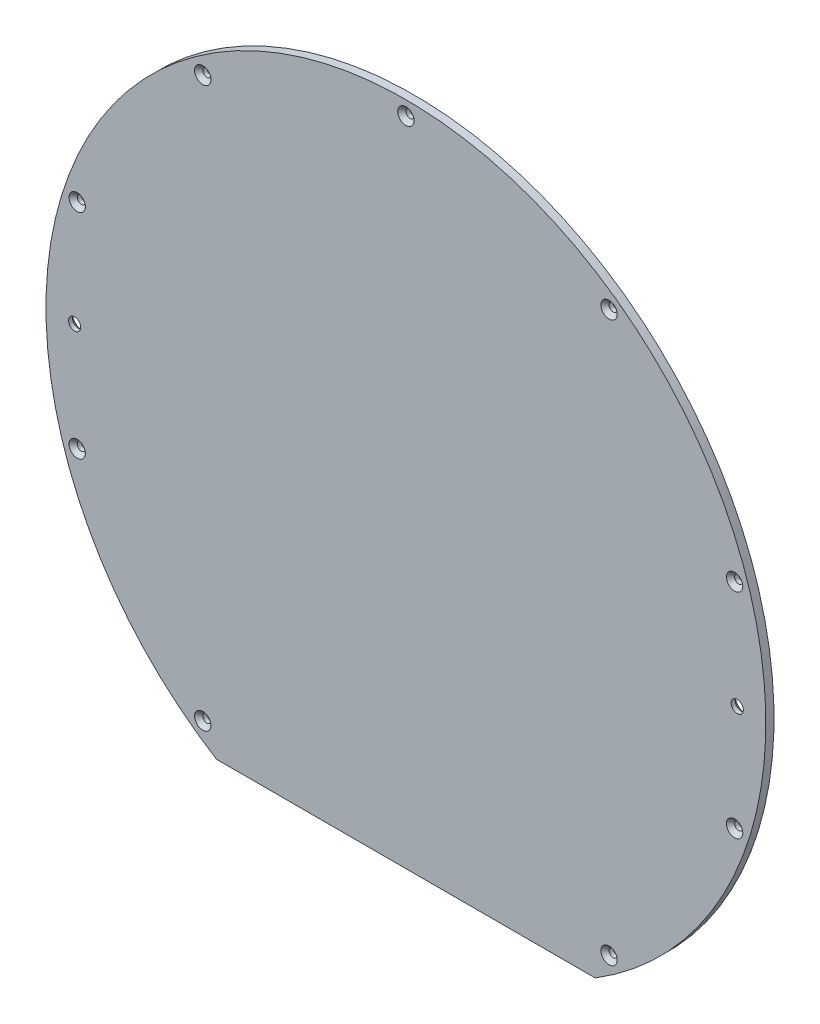
ISO-10303-21;
HEADER;
FILE_DESCRIPTION(('STEP AP214'),'2;1');
FILE_NAME('part.step','',(''),(''),'','','');
FILE_SCHEMA(('AUTOMOTIVE_DESIGN { 1 0 10303 214 1 1 1 1 }'));
ENDSEC;
DATA;
#1=APPLICATION_CONTEXT('core data for automotive mechanical design processes');
#2=APPLICATION_PROTOCOL_DEFINITION('international standard','automotive_design',2000,#1);
#3=PRODUCT_CONTEXT('',#1,'mechanical');
#4=PRODUCT('Part','Part','',(#3));
#5=PRODUCT_RELATED_PRODUCT_CATEGORY('part','',(#4));
#6=PRODUCT_DEFINITION_FORMATION('','',#4);
#7=PRODUCT_DEFINITION_CONTEXT('part definition',#1,'design');
#8=PRODUCT_DEFINITION('design','',#6,#7);
#9=PRODUCT_DEFINITION_SHAPE('','',#8);
#10=(LENGTH_UNIT() NAMED_UNIT(*) SI_UNIT(.MILLI.,.METRE.));
#11=(NAMED_UNIT(*) PLANE_ANGLE_UNIT() SI_UNIT($,.RADIAN.));
#12=(NAMED_UNIT(*) SI_UNIT($,.STERADIAN.) SOLID_ANGLE_UNIT());
#13=UNCERTAINTY_MEASURE_WITH_UNIT(LENGTH_MEASURE(1.E-05),#10,'distance_accuracy_value','');
#14=(GEOMETRIC_REPRESENTATION_CONTEXT(3) GLOBAL_UNCERTAINTY_ASSIGNED_CONTEXT((#13)) GLOBAL_UNIT_ASSIGNED_CONTEXT((#10,
#11,#12)) REPRESENTATION_CONTEXT('',''));
#15=CARTESIAN_POINT('',(0.,0.,0.));
#16=DIRECTION('',(0.,0.,1.));
#17=DIRECTION('',(1.,0.,0.));
#18=AXIS2_PLACEMENT_3D('',#15,#16,#17);
#19=CARTESIAN_POINT('',(0.,0.,2.));
#20=DIRECTION('',(0.,0.,-1.));
#21=DIRECTION('',(-1.,0.,0.));
#22=AXIS2_PLACEMENT_3D('',#19,#20,#21);
#23=CYLINDRICAL_SURFACE('',#22,88.);
#24=CARTESIAN_POINT('',(0.,0.,0.));
#25=DIRECTION('',(0.,0.,1.));
#26=DIRECTION('',(1.,0.,0.));
#27=AXIS2_PLACEMENT_3D('',#24,#25,#26);
#28=CIRCLE('',#27,88.);
#29=CARTESIAN_POINT('',(46.3033476111609,-74.8331477354788,0.));
#30=VERTEX_POINT('',#29);
#31=CARTESIAN_POINT('',(-46.3033476111609,-74.8331477354788,0.));
#32=VERTEX_POINT('',#31);
#33=EDGE_CURVE('E67',#30,#32,#28,.T.);
#34=ORIENTED_EDGE('',*,*,#33,.T.);
#35=DIRECTION('',(0.,0.,-1.));
#36=VECTOR('',#35,1.);
#37=CARTESIAN_POINT('',(-46.3033476111609,-74.8331477354788,2.));
#38=LINE('',#37,#36);
#39=CARTESIAN_POINT('',(-46.3033476111609,-74.8331477354788,2.));
#40=VERTEX_POINT('',#39);
#41=EDGE_CURVE('E64',#40,#32,#38,.T.);
#42=ORIENTED_EDGE('',*,*,#41,.F.);
#43=CARTESIAN_POINT('',(0.,0.,2.));
#44=DIRECTION('',(0.,0.,1.));
#45=DIRECTION('',(1.,0.,0.));
#46=AXIS2_PLACEMENT_3D('',#43,#44,#45);
#47=CIRCLE('',#46,88.);
#48=CARTESIAN_POINT('',(46.3033476111609,-74.8331477354788,2.));
#49=VERTEX_POINT('',#48);
#50=EDGE_CURVE('E66',#49,#40,#47,.T.);
#51=ORIENTED_EDGE('',*,*,#50,.F.);
#52=DIRECTION('',(0.,0.,-1.));
#53=VECTOR('',#52,1.);
#54=CARTESIAN_POINT('',(46.3033476111609,-74.8331477354788,2.));
#55=LINE('',#54,#53);
#56=EDGE_CURVE('E61',#49,#30,#55,.T.);
#57=ORIENTED_EDGE('',*,*,#56,.T.);
#58=EDGE_LOOP('',(#34,#42,#51,#57));
#59=FACE_BOUND('',#58,.T.);
#60=ADVANCED_FACE('F32',(#59),#23,.T.);
#61=CARTESIAN_POINT('',(-46.3033476111609,-74.8331477354788,2.));
#62=DIRECTION('',(0.,1.,0.));
#63=DIRECTION('',(0.,0.,1.));
#64=AXIS2_PLACEMENT_3D('',#61,#62,#63);
#65=PLANE('',#64);
#66=DIRECTION('',(1.,0.,0.));
#67=VECTOR('',#66,1.);
#68=CARTESIAN_POINT('',(-46.3033476111609,-74.8331477354788,0.));
#69=LINE('',#68,#67);
#70=EDGE_CURVE('E56',#32,#30,#69,.T.);
#71=ORIENTED_EDGE('',*,*,#70,.T.);
#72=ORIENTED_EDGE('',*,*,#56,.F.);
#73=DIRECTION('',(1.,0.,0.));
#74=VECTOR('',#73,1.);
#75=CARTESIAN_POINT('',(-46.3033476111609,-74.8331477354788,2.));
#76=LINE('',#75,#74);
#77=EDGE_CURVE('E48',#40,#49,#76,.T.);
#78=ORIENTED_EDGE('',*,*,#77,.F.);
#79=ORIENTED_EDGE('',*,*,#41,.T.);
#80=EDGE_LOOP('',(#71,#72,#78,#79));
#81=FACE_BOUND('',#80,.T.);
#82=ADVANCED_FACE('F60',(#81),#65,.F.);
#83=CARTESIAN_POINT('',(0.,0.,2.));
#84=DIRECTION('',(0.,0.,1.));
#85=DIRECTION('',(1.,0.,0.));
#86=AXIS2_PLACEMENT_3D('',#83,#84,#85);
#87=PLANE('',#86);
#88=CARTESIAN_POINT('',(49.6678538187136,-68.3619360246834,2.));
#89=DIRECTION('',(0.,0.,1.));
#90=DIRECTION('',(1.,0.,0.));
#91=AXIS2_PLACEMENT_3D('',#88,#89,#90);
#92=CIRCLE('',#91,2.00000000000003);
#93=CARTESIAN_POINT('',(51.6678538187136,-68.3619360246834,2.));
#94=VERTEX_POINT('',#93);
#95=EDGE_CURVE('E120',#94,#94,#92,.F.);
#96=ORIENTED_EDGE('',*,*,#95,.T.);
#97=EDGE_LOOP('',(#96));
#98=FACE_BOUND('',#97,.T.);
#99=CARTESIAN_POINT('',(80.3642756269403,-26.1119360246834,2.));
#100=DIRECTION('',(0.,0.,1.));
#101=DIRECTION('',(1.,0.,0.));
#102=AXIS2_PLACEMENT_3D('',#99,#100,#101);
#103=CIRCLE('',#102,2.00000000000003);
#104=CARTESIAN_POINT('',(82.3642756269403,-26.1119360246834,2.));
#105=VERTEX_POINT('',#104);
#106=EDGE_CURVE('E117',#105,#105,#103,.F.);
#107=ORIENTED_EDGE('',*,*,#106,.T.);
#108=EDGE_LOOP('',(#107));
#109=FACE_BOUND('',#108,.T.);
#110=CARTESIAN_POINT('',(80.3642756269406,26.1119360246828,2.));
#111=DIRECTION('',(0.,0.,1.));
#112=DIRECTION('',(1.,0.,0.));
#113=AXIS2_PLACEMENT_3D('',#110,#111,#112);
#114=CIRCLE('',#113,2.00000000000003);
#115=CARTESIAN_POINT('',(82.3642756269406,26.1119360246828,2.));
#116=VERTEX_POINT('',#115);
#117=EDGE_CURVE('E114',#116,#116,#114,.F.);
#118=ORIENTED_EDGE('',*,*,#117,.T.);
#119=EDGE_LOOP('',(#118));
#120=FACE_BOUND('',#119,.T.);
#121=CARTESIAN_POINT('',(49.6678538187141,68.361936024683,2.));
#122=DIRECTION('',(0.,0.,1.));
#123=DIRECTION('',(1.,0.,0.));
#124=AXIS2_PLACEMENT_3D('',#121,#122,#123);
#125=CIRCLE('',#124,2.00000000000003);
#126=CARTESIAN_POINT('',(51.6678538187141,68.361936024683,2.));
#127=VERTEX_POINT('',#126);
#128=EDGE_CURVE('E111',#127,#127,#125,.F.);
#129=ORIENTED_EDGE('',*,*,#128,.T.);
#130=EDGE_LOOP('',(#129));
#131=FACE_BOUND('',#130,.T.);
#132=CARTESIAN_POINT('',(0.,84.5,2.));
#133=DIRECTION('',(0.,0.,1.));
#134=DIRECTION('',(1.,0.,0.));
#135=AXIS2_PLACEMENT_3D('',#132,#133,#134);
#136=CIRCLE('',#135,2.00000000000003);
#137=CARTESIAN_POINT('',(2.00000000000003,84.5,2.));
#138=VERTEX_POINT('',#137);
#139=EDGE_CURVE('E108',#138,#138,#136,.F.);
#140=ORIENTED_EDGE('',*,*,#139,.T.);
#141=EDGE_LOOP('',(#140));
#142=FACE_BOUND('',#141,.T.);
#143=CARTESIAN_POINT('',(-49.6678538187131,68.3619360246837,2.));
#144=DIRECTION('',(0.,0.,1.));
#145=DIRECTION('',(1.,0.,0.));
#146=AXIS2_PLACEMENT_3D('',#143,#144,#145);
#147=CIRCLE('',#146,2.00000000000003);
#148=CARTESIAN_POINT('',(-47.667853818713,68.3619360246837,2.));
#149=VERTEX_POINT('',#148);
#150=EDGE_CURVE('E105',#149,#149,#147,.F.);
#151=ORIENTED_EDGE('',*,*,#150,.T.);
#152=EDGE_LOOP('',(#151));
#153=FACE_BOUND('',#152,.T.);
#154=CARTESIAN_POINT('',(-80.3642756269403,26.111936024684,2.));
#155=DIRECTION('',(0.,0.,1.));
#156=DIRECTION('',(1.,0.,0.));
#157=AXIS2_PLACEMENT_3D('',#154,#155,#156);
#158=CIRCLE('',#157,1.99999999999997);
#159=CARTESIAN_POINT('',(-78.3642756269403,26.111936024684,2.));
#160=VERTEX_POINT('',#159);
#161=EDGE_CURVE('E102',#160,#160,#158,.F.);
#162=ORIENTED_EDGE('',*,*,#161,.T.);
#163=EDGE_LOOP('',(#162));
#164=FACE_BOUND('',#163,.T.);
#165=CARTESIAN_POINT('',(-80.3642756269408,-26.1119360246823,2.));
#166=DIRECTION('',(0.,0.,1.));
#167=DIRECTION('',(1.,0.,0.));
#168=AXIS2_PLACEMENT_3D('',#165,#166,#167);
#169=CIRCLE('',#168,1.99999999999997);
#170=CARTESIAN_POINT('',(-78.3642756269408,-26.1119360246823,2.));
#171=VERTEX_POINT('',#170);
#172=EDGE_CURVE('E99',#171,#171,#169,.F.);
#173=ORIENTED_EDGE('',*,*,#172,.T.);
#174=EDGE_LOOP('',(#173));
#175=FACE_BOUND('',#174,.T.);
#176=CARTESIAN_POINT('',(-49.6678538187146,-68.3619360246827,2.));
#177=DIRECTION('',(0.,0.,1.));
#178=DIRECTION('',(1.,0.,0.));
#179=AXIS2_PLACEMENT_3D('',#176,#177,#178);
#180=CIRCLE('',#179,2.00000000000003);
#181=CARTESIAN_POINT('',(-47.6678538187146,-68.3619360246827,2.));
#182=VERTEX_POINT('',#181);
#183=EDGE_CURVE('E96',#182,#182,#180,.F.);
#184=ORIENTED_EDGE('',*,*,#183,.T.);
#185=EDGE_LOOP('',(#184));
#186=FACE_BOUND('',#185,.T.);
#187=CARTESIAN_POINT('',(-81.,0.,2.));
#188=DIRECTION('',(0.,0.,1.));
#189=DIRECTION('',(1.,0.,0.));
#190=AXIS2_PLACEMENT_3D('',#187,#188,#189);
#191=CIRCLE('',#190,1.5);
#192=CARTESIAN_POINT('',(-79.5,0.,2.));
#193=VERTEX_POINT('',#192);
#194=EDGE_CURVE('E75',#193,#193,#191,.T.);
#195=ORIENTED_EDGE('',*,*,#194,.F.);
#196=EDGE_LOOP('',(#195));
#197=FACE_BOUND('',#196,.T.);
#198=CARTESIAN_POINT('',(81.,0.,2.));
#199=DIRECTION('',(0.,0.,1.));
#200=DIRECTION('',(1.,0.,0.));
#201=AXIS2_PLACEMENT_3D('',#198,#199,#200);
#202=CIRCLE('',#201,1.5);
#203=CARTESIAN_POINT('',(82.5,0.,2.));
#204=VERTEX_POINT('',#203);
#205=EDGE_CURVE('E72',#204,#204,#202,.T.);
#206=ORIENTED_EDGE('',*,*,#205,.F.);
#207=EDGE_LOOP('',(#206));
#208=FACE_BOUND('',#207,.T.);
#209=ORIENTED_EDGE('',*,*,#50,.T.);
#210=ORIENTED_EDGE('',*,*,#77,.T.);
#211=EDGE_LOOP('',(#209,#210));
#212=FACE_BOUND('',#211,.T.);
#213=ADVANCED_FACE('F164',(#98,#109,#120,#131,#142,#153,#164,#175,#186,#197,#208,#212),#87,.T.);
#214=CARTESIAN_POINT('',(0.,0.,0.));
#215=DIRECTION('',(0.,0.,1.));
#216=DIRECTION('',(1.,0.,0.));
#217=AXIS2_PLACEMENT_3D('',#214,#215,#216);
#218=PLANE('',#217);
#219=CARTESIAN_POINT('',(49.6678538187136,-68.3619360246834,0.));
#220=DIRECTION('',(0.,0.,1.));
#221=DIRECTION('',(1.,0.,0.));
#222=AXIS2_PLACEMENT_3D('',#219,#220,#221);
#223=CIRCLE('',#222,0.999999999999992);
#224=CARTESIAN_POINT('',(50.6678538187135,-68.3619360246834,0.));
#225=VERTEX_POINT('',#224);
#226=EDGE_CURVE('E281',#225,#225,#223,.F.);
#227=ORIENTED_EDGE('',*,*,#226,.F.);
#228=EDGE_LOOP('',(#227));
#229=FACE_BOUND('',#228,.T.);
#230=CARTESIAN_POINT('',(80.3642756269403,-26.1119360246834,0.));
#231=DIRECTION('',(0.,0.,1.));
#232=DIRECTION('',(1.,0.,0.));
#233=AXIS2_PLACEMENT_3D('',#230,#231,#232);
#234=CIRCLE('',#233,0.999999999999998);
#235=CARTESIAN_POINT('',(81.3642756269403,-26.1119360246834,0.));
#236=VERTEX_POINT('',#235);
#237=EDGE_CURVE('E282',#236,#236,#234,.F.);
#238=ORIENTED_EDGE('',*,*,#237,.F.);
#239=EDGE_LOOP('',(#238));
#240=FACE_BOUND('',#239,.T.);
#241=CARTESIAN_POINT('',(80.3642756269406,26.1119360246828,0.));
#242=DIRECTION('',(0.,0.,1.));
#243=DIRECTION('',(1.,0.,0.));
#244=AXIS2_PLACEMENT_3D('',#241,#242,#243);
#245=CIRCLE('',#244,0.999999999999998);
#246=CARTESIAN_POINT('',(81.3642756269406,26.1119360246828,0.));
#247=VERTEX_POINT('',#246);
#248=EDGE_CURVE('E285',#247,#247,#245,.F.);
#249=ORIENTED_EDGE('',*,*,#248,.F.);
#250=EDGE_LOOP('',(#249));
#251=FACE_BOUND('',#250,.T.);
#252=CARTESIAN_POINT('',(49.6678538187141,68.361936024683,0.));
#253=DIRECTION('',(0.,0.,1.));
#254=DIRECTION('',(1.,0.,0.));
#255=AXIS2_PLACEMENT_3D('',#252,#253,#254);
#256=CIRCLE('',#255,0.999999999999998);
#257=CARTESIAN_POINT('',(50.6678538187141,68.361936024683,0.));
#258=VERTEX_POINT('',#257);
#259=EDGE_CURVE('E224',#258,#258,#256,.F.);
#260=ORIENTED_EDGE('',*,*,#259,.F.);
#261=EDGE_LOOP('',(#260));
#262=FACE_BOUND('',#261,.T.);
#263=CARTESIAN_POINT('',(0.,84.5,0.));
#264=DIRECTION('',(0.,0.,1.));
#265=DIRECTION('',(1.,0.,0.));
#266=AXIS2_PLACEMENT_3D('',#263,#264,#265);
#267=CIRCLE('',#266,1.);
#268=CARTESIAN_POINT('',(1.,84.5,0.));
#269=VERTEX_POINT('',#268);
#270=EDGE_CURVE('E218',#269,#269,#267,.F.);
#271=ORIENTED_EDGE('',*,*,#270,.F.);
#272=EDGE_LOOP('',(#271));
#273=FACE_BOUND('',#272,.T.);
#274=CARTESIAN_POINT('',(-49.6678538187131,68.3619360246837,0.));
#275=DIRECTION('',(0.,0.,1.));
#276=DIRECTION('',(1.,0.,0.));
#277=AXIS2_PLACEMENT_3D('',#274,#275,#276);
#278=CIRCLE('',#277,1.00000000000001);
#279=CARTESIAN_POINT('',(-48.667853818713,68.3619360246837,0.));
#280=VERTEX_POINT('',#279);
#281=EDGE_CURVE('E215',#280,#280,#278,.F.);
#282=ORIENTED_EDGE('',*,*,#281,.F.);
#283=EDGE_LOOP('',(#282));
#284=FACE_BOUND('',#283,.T.);
#285=CARTESIAN_POINT('',(-80.3642756269403,26.111936024684,0.));
#286=DIRECTION('',(0.,0.,1.));
#287=DIRECTION('',(1.,0.,0.));
#288=AXIS2_PLACEMENT_3D('',#285,#286,#287);
#289=CIRCLE('',#288,0.999999999999998);
#290=CARTESIAN_POINT('',(-79.3642756269403,26.111936024684,0.));
#291=VERTEX_POINT('',#290);
#292=EDGE_CURVE('E217',#291,#291,#289,.F.);
#293=ORIENTED_EDGE('',*,*,#292,.F.);
#294=EDGE_LOOP('',(#293));
#295=FACE_BOUND('',#294,.T.);
#296=CARTESIAN_POINT('',(-80.3642756269408,-26.1119360246823,0.));
#297=DIRECTION('',(0.,0.,1.));
#298=DIRECTION('',(1.,0.,0.));
#299=AXIS2_PLACEMENT_3D('',#296,#297,#298);
#300=CIRCLE('',#299,0.999999999999998);
#301=CARTESIAN_POINT('',(-79.3642756269408,-26.1119360246823,0.));
#302=VERTEX_POINT('',#301);
#303=EDGE_CURVE('E221',#302,#302,#300,.F.);
#304=ORIENTED_EDGE('',*,*,#303,.F.);
#305=EDGE_LOOP('',(#304));
#306=FACE_BOUND('',#305,.T.);
#307=CARTESIAN_POINT('',(-49.6678538187146,-68.3619360246827,0.));
#308=DIRECTION('',(0.,0.,1.));
#309=DIRECTION('',(1.,0.,0.));
#310=AXIS2_PLACEMENT_3D('',#307,#308,#309);
#311=CIRCLE('',#310,1.00000000000001);
#312=CARTESIAN_POINT('',(-48.6678538187146,-68.3619360246827,0.));
#313=VERTEX_POINT('',#312);
#314=EDGE_CURVE('E230',#313,#313,#311,.F.);
#315=ORIENTED_EDGE('',*,*,#314,.F.);
#316=EDGE_LOOP('',(#315));
#317=FACE_BOUND('',#316,.T.);
#318=CARTESIAN_POINT('',(81.,0.,0.));
#319=DIRECTION('',(0.,0.,1.));
#320=DIRECTION('',(1.,0.,0.));
#321=AXIS2_PLACEMENT_3D('',#318,#319,#320);
#322=CIRCLE('',#321,2.50000000000003);
#323=CARTESIAN_POINT('',(83.5,0.,0.));
#324=VERTEX_POINT('',#323);
#325=EDGE_CURVE('E87',#324,#324,#322,.T.);
#326=ORIENTED_EDGE('',*,*,#325,.T.);
#327=EDGE_LOOP('',(#326));
#328=FACE_BOUND('',#327,.T.);
#329=CARTESIAN_POINT('',(-81.,0.,0.));
#330=DIRECTION('',(0.,0.,1.));
#331=DIRECTION('',(1.,0.,0.));
#332=AXIS2_PLACEMENT_3D('',#329,#330,#331);
#333=CIRCLE('',#332,2.49999999999995);
#334=CARTESIAN_POINT('',(-78.5000000000001,0.,0.));
#335=VERTEX_POINT('',#334);
#336=EDGE_CURVE('E84',#335,#335,#333,.T.);
#337=ORIENTED_EDGE('',*,*,#336,.T.);
#338=EDGE_LOOP('',(#337));
#339=FACE_BOUND('',#338,.T.);
#340=ORIENTED_EDGE('',*,*,#33,.F.);
#341=ORIENTED_EDGE('',*,*,#70,.F.);
#342=EDGE_LOOP('',(#340,#341));
#343=FACE_BOUND('',#342,.T.);
#344=ADVANCED_FACE('F71',(#229,#240,#251,#262,#273,#284,#295,#306,#317,#328,#339,#343),#218,.F.);
#345=CARTESIAN_POINT('',(81.,0.,-0.00100000000000013));
#346=DIRECTION('',(0.,0.,1.));
#347=DIRECTION('',(1.,0.,0.));
#348=AXIS2_PLACEMENT_3D('',#345,#346,#347);
#349=CYLINDRICAL_SURFACE('',#348,1.5);
#350=CARTESIAN_POINT('',(81.,0.,1.00000000000004));
#351=DIRECTION('',(0.,0.,1.));
#352=DIRECTION('',(1.,0.,0.));
#353=AXIS2_PLACEMENT_3D('',#350,#351,#352);
#354=CIRCLE('',#353,1.5);
#355=CARTESIAN_POINT('',(82.5,0.,1.00000000000004));
#356=VERTEX_POINT('',#355);
#357=EDGE_CURVE('E81',#356,#356,#354,.F.);
#358=ORIENTED_EDGE('',*,*,#357,.T.);
#359=EDGE_LOOP('',(#358));
#360=FACE_BOUND('',#359,.T.);
#361=ORIENTED_EDGE('',*,*,#205,.T.);
#362=EDGE_LOOP('',(#361));
#363=FACE_BOUND('',#362,.T.);
#364=ADVANCED_FACE('F240',(#360,#363),#349,.F.);
#365=CARTESIAN_POINT('',(-81.,0.,-0.00100000000000013));
#366=DIRECTION('',(0.,0.,1.));
#367=DIRECTION('',(1.,0.,0.));
#368=AXIS2_PLACEMENT_3D('',#365,#366,#367);
#369=CYLINDRICAL_SURFACE('',#368,1.5);
#370=CARTESIAN_POINT('',(-81.,0.,0.999999999999955));
#371=DIRECTION('',(0.,0.,1.));
#372=DIRECTION('',(1.,0.,0.));
#373=AXIS2_PLACEMENT_3D('',#370,#371,#372);
#374=CIRCLE('',#373,1.5);
#375=CARTESIAN_POINT('',(-79.5,0.,0.999999999999955));
#376=VERTEX_POINT('',#375);
#377=EDGE_CURVE('E90',#376,#376,#374,.F.);
#378=ORIENTED_EDGE('',*,*,#377,.T.);
#379=EDGE_LOOP('',(#378));
#380=FACE_BOUND('',#379,.T.);
#381=ORIENTED_EDGE('',*,*,#194,.T.);
#382=EDGE_LOOP('',(#381));
#383=FACE_BOUND('',#382,.T.);
#384=ADVANCED_FACE('F172',(#380,#383),#369,.F.);
#385=CARTESIAN_POINT('',(81.,0.,1.00000000000004));
#386=DIRECTION('',(0.,0.,-1.));
#387=DIRECTION('',(-1.,0.,0.));
#388=AXIS2_PLACEMENT_3D('',#385,#386,#387);
#389=CONICAL_SURFACE('',#388,1.5,0.785398163397446);
#390=ORIENTED_EDGE('',*,*,#325,.F.);
#391=EDGE_LOOP('',(#390));
#392=FACE_BOUND('',#391,.T.);
#393=ORIENTED_EDGE('',*,*,#357,.F.);
#394=EDGE_LOOP('',(#393));
#395=FACE_BOUND('',#394,.T.);
#396=ADVANCED_FACE('F168',(#392,#395),#389,.F.);
#397=CARTESIAN_POINT('',(-81.,0.,0.999999999999955));
#398=DIRECTION('',(0.,0.,-1.));
#399=DIRECTION('',(-1.,0.,0.));
#400=AXIS2_PLACEMENT_3D('',#397,#398,#399);
#401=CONICAL_SURFACE('',#400,1.5,0.785398163397446);
#402=ORIENTED_EDGE('',*,*,#336,.F.);
#403=EDGE_LOOP('',(#402));
#404=FACE_BOUND('',#403,.T.);
#405=ORIENTED_EDGE('',*,*,#377,.F.);
#406=EDGE_LOOP('',(#405));
#407=FACE_BOUND('',#406,.T.);
#408=ADVANCED_FACE('F171',(#404,#407),#401,.F.);
#409=CARTESIAN_POINT('',(-49.6678538187146,-68.3619360246827,-0.00100000000000013));
#410=DIRECTION('',(0.,0.,1.));
#411=DIRECTION('',(1.,0.,0.));
#412=AXIS2_PLACEMENT_3D('',#409,#410,#411);
#413=CYLINDRICAL_SURFACE('',#412,1.00000000000001);
#414=CARTESIAN_POINT('',(-49.6678538187146,-68.3619360246827,1.));
#415=DIRECTION('',(0.,0.,1.));
#416=DIRECTION('',(1.,0.,0.));
#417=AXIS2_PLACEMENT_3D('',#414,#415,#416);
#418=CIRCLE('',#417,1.00000000000001);
#419=CARTESIAN_POINT('',(-48.6678538187146,-68.3619360246827,1.));
#420=VERTEX_POINT('',#419);
#421=EDGE_CURVE('E11',#420,#420,#418,.T.);
#422=ORIENTED_EDGE('',*,*,#421,.T.);
#423=EDGE_LOOP('',(#422));
#424=FACE_BOUND('',#423,.T.);
#425=ORIENTED_EDGE('',*,*,#314,.T.);
#426=EDGE_LOOP('',(#425));
#427=FACE_BOUND('',#426,.T.);
#428=ADVANCED_FACE('F176',(#424,#427),#413,.F.);
#429=CARTESIAN_POINT('',(-80.3642756269408,-26.1119360246823,-0.00100000000000013));
#430=DIRECTION('',(0.,0.,1.));
#431=DIRECTION('',(1.,0.,0.));
#432=AXIS2_PLACEMENT_3D('',#429,#430,#431);
#433=CYLINDRICAL_SURFACE('',#432,0.999999999999998);
#434=CARTESIAN_POINT('',(-80.3642756269408,-26.1119360246823,1.00000000000002));
#435=DIRECTION('',(0.,0.,1.));
#436=DIRECTION('',(1.,0.,0.));
#437=AXIS2_PLACEMENT_3D('',#434,#435,#436);
#438=CIRCLE('',#437,0.999999999999998);
#439=CARTESIAN_POINT('',(-79.3642756269408,-26.1119360246823,1.00000000000002));
#440=VERTEX_POINT('',#439);
#441=EDGE_CURVE('E41',#440,#440,#438,.T.);
#442=ORIENTED_EDGE('',*,*,#441,.T.);
#443=EDGE_LOOP('',(#442));
#444=FACE_BOUND('',#443,.T.);
#445=ORIENTED_EDGE('',*,*,#303,.T.);
#446=EDGE_LOOP('',(#445));
#447=FACE_BOUND('',#446,.T.);
#448=ADVANCED_FACE('F143',(#444,#447),#433,.F.);
#449=CARTESIAN_POINT('',(-80.3642756269403,26.111936024684,-0.00100000000000013));
#450=DIRECTION('',(0.,0.,1.));
#451=DIRECTION('',(1.,0.,0.));
#452=AXIS2_PLACEMENT_3D('',#449,#450,#451);
#453=CYLINDRICAL_SURFACE('',#452,0.999999999999998);
#454=CARTESIAN_POINT('',(-80.3642756269403,26.111936024684,1.00000000000002));
#455=DIRECTION('',(0.,0.,1.));
#456=DIRECTION('',(1.,0.,0.));
#457=AXIS2_PLACEMENT_3D('',#454,#455,#456);
#458=CIRCLE('',#457,0.999999999999998);
#459=CARTESIAN_POINT('',(-79.3642756269403,26.111936024684,1.00000000000002));
#460=VERTEX_POINT('',#459);
#461=EDGE_CURVE('E138',#460,#460,#458,.T.);
#462=ORIENTED_EDGE('',*,*,#461,.T.);
#463=EDGE_LOOP('',(#462));
#464=FACE_BOUND('',#463,.T.);
#465=ORIENTED_EDGE('',*,*,#292,.T.);
#466=EDGE_LOOP('',(#465));
#467=FACE_BOUND('',#466,.T.);
#468=ADVANCED_FACE('F211',(#464,#467),#453,.F.);
#469=CARTESIAN_POINT('',(-49.6678538187131,68.3619360246837,-0.00100000000000013));
#470=DIRECTION('',(0.,0.,1.));
#471=DIRECTION('',(1.,0.,0.));
#472=AXIS2_PLACEMENT_3D('',#469,#470,#471);
#473=CYLINDRICAL_SURFACE('',#472,1.00000000000001);
#474=CARTESIAN_POINT('',(-49.6678538187131,68.3619360246837,1.00000000000001));
#475=DIRECTION('',(0.,0.,1.));
#476=DIRECTION('',(1.,0.,0.));
#477=AXIS2_PLACEMENT_3D('',#474,#475,#476);
#478=CIRCLE('',#477,1.00000000000001);
#479=CARTESIAN_POINT('',(-48.667853818713,68.3619360246837,1.00000000000001));
#480=VERTEX_POINT('',#479);
#481=EDGE_CURVE('E135',#480,#480,#478,.T.);
#482=ORIENTED_EDGE('',*,*,#481,.T.);
#483=EDGE_LOOP('',(#482));
#484=FACE_BOUND('',#483,.T.);
#485=ORIENTED_EDGE('',*,*,#281,.T.);
#486=EDGE_LOOP('',(#485));
#487=FACE_BOUND('',#486,.T.);
#488=ADVANCED_FACE('F207',(#484,#487),#473,.F.);
#489=CARTESIAN_POINT('',(0.,84.5,-0.00100000000000013));
#490=DIRECTION('',(0.,0.,1.));
#491=DIRECTION('',(1.,0.,0.));
#492=AXIS2_PLACEMENT_3D('',#489,#490,#491);
#493=CYLINDRICAL_SURFACE('',#492,1.);
#494=CARTESIAN_POINT('',(0.,84.5,0.999999999999995));
#495=DIRECTION('',(0.,0.,1.));
#496=DIRECTION('',(1.,0.,0.));
#497=AXIS2_PLACEMENT_3D('',#494,#495,#496);
#498=CIRCLE('',#497,1.);
#499=CARTESIAN_POINT('',(1.,84.5,0.999999999999995));
#500=VERTEX_POINT('',#499);
#501=EDGE_CURVE('E132',#500,#500,#498,.T.);
#502=ORIENTED_EDGE('',*,*,#501,.T.);
#503=EDGE_LOOP('',(#502));
#504=FACE_BOUND('',#503,.T.);
#505=ORIENTED_EDGE('',*,*,#270,.T.);
#506=EDGE_LOOP('',(#505));
#507=FACE_BOUND('',#506,.T.);
#508=ADVANCED_FACE('F210',(#504,#507),#493,.F.);
#509=CARTESIAN_POINT('',(49.6678538187141,68.361936024683,-0.00100000000000013));
#510=DIRECTION('',(0.,0.,1.));
#511=DIRECTION('',(1.,0.,0.));
#512=AXIS2_PLACEMENT_3D('',#509,#510,#511);
#513=CYLINDRICAL_SURFACE('',#512,0.999999999999998);
#514=CARTESIAN_POINT('',(49.6678538187141,68.361936024683,0.999999999999993));
#515=DIRECTION('',(0.,0.,1.));
#516=DIRECTION('',(1.,0.,0.));
#517=AXIS2_PLACEMENT_3D('',#514,#515,#516);
#518=CIRCLE('',#517,0.999999999999998);
#519=CARTESIAN_POINT('',(50.6678538187141,68.361936024683,0.999999999999993));
#520=VERTEX_POINT('',#519);
#521=EDGE_CURVE('E129',#520,#520,#518,.T.);
#522=ORIENTED_EDGE('',*,*,#521,.T.);
#523=EDGE_LOOP('',(#522));
#524=FACE_BOUND('',#523,.T.);
#525=ORIENTED_EDGE('',*,*,#259,.T.);
#526=EDGE_LOOP('',(#525));
#527=FACE_BOUND('',#526,.T.);
#528=ADVANCED_FACE('F260',(#524,#527),#513,.F.);
#529=CARTESIAN_POINT('',(80.3642756269406,26.1119360246828,-0.00100000000000013));
#530=DIRECTION('',(0.,0.,1.));
#531=DIRECTION('',(1.,0.,0.));
#532=AXIS2_PLACEMENT_3D('',#529,#530,#531);
#533=CYLINDRICAL_SURFACE('',#532,0.999999999999998);
#534=CARTESIAN_POINT('',(80.3642756269406,26.1119360246828,0.999999999999993));
#535=DIRECTION('',(0.,0.,1.));
#536=DIRECTION('',(1.,0.,0.));
#537=AXIS2_PLACEMENT_3D('',#534,#535,#536);
#538=CIRCLE('',#537,0.999999999999998);
#539=CARTESIAN_POINT('',(81.3642756269406,26.1119360246828,0.999999999999993));
#540=VERTEX_POINT('',#539);
#541=EDGE_CURVE('E126',#540,#540,#538,.T.);
#542=ORIENTED_EDGE('',*,*,#541,.T.);
#543=EDGE_LOOP('',(#542));
#544=FACE_BOUND('',#543,.T.);
#545=ORIENTED_EDGE('',*,*,#248,.T.);
#546=EDGE_LOOP('',(#545));
#547=FACE_BOUND('',#546,.T.);
#548=ADVANCED_FACE('F264',(#544,#547),#533,.F.);
#549=CARTESIAN_POINT('',(80.3642756269403,-26.1119360246834,-0.00100000000000013));
#550=DIRECTION('',(0.,0.,1.));
#551=DIRECTION('',(1.,0.,0.));
#552=AXIS2_PLACEMENT_3D('',#549,#550,#551);
#553=CYLINDRICAL_SURFACE('',#552,0.999999999999998);
#554=CARTESIAN_POINT('',(80.3642756269403,-26.1119360246834,0.999999999999993));
#555=DIRECTION('',(0.,0.,1.));
#556=DIRECTION('',(1.,0.,0.));
#557=AXIS2_PLACEMENT_3D('',#554,#555,#556);
#558=CIRCLE('',#557,0.999999999999998);
#559=CARTESIAN_POINT('',(81.3642756269403,-26.1119360246834,0.999999999999993));
#560=VERTEX_POINT('',#559);
#561=EDGE_CURVE('E123',#560,#560,#558,.T.);
#562=ORIENTED_EDGE('',*,*,#561,.T.);
#563=EDGE_LOOP('',(#562));
#564=FACE_BOUND('',#563,.T.);
#565=ORIENTED_EDGE('',*,*,#237,.T.);
#566=EDGE_LOOP('',(#565));
#567=FACE_BOUND('',#566,.T.);
#568=ADVANCED_FACE('F268',(#564,#567),#553,.F.);
#569=CARTESIAN_POINT('',(49.6678538187136,-68.3619360246834,-0.00100000000000013));
#570=DIRECTION('',(0.,0.,1.));
#571=DIRECTION('',(1.,0.,0.));
#572=AXIS2_PLACEMENT_3D('',#569,#570,#571);
#573=CYLINDRICAL_SURFACE('',#572,0.999999999999992);
#574=CARTESIAN_POINT('',(49.6678538187136,-68.3619360246834,0.999999999999987));
#575=DIRECTION('',(0.,0.,1.));
#576=DIRECTION('',(1.,0.,0.));
#577=AXIS2_PLACEMENT_3D('',#574,#575,#576);
#578=CIRCLE('',#577,0.999999999999992);
#579=CARTESIAN_POINT('',(50.6678538187135,-68.3619360246834,0.999999999999987));
#580=VERTEX_POINT('',#579);
#581=EDGE_CURVE('E93',#580,#580,#578,.T.);
#582=ORIENTED_EDGE('',*,*,#581,.T.);
#583=EDGE_LOOP('',(#582));
#584=FACE_BOUND('',#583,.T.);
#585=ORIENTED_EDGE('',*,*,#226,.T.);
#586=EDGE_LOOP('',(#585));
#587=FACE_BOUND('',#586,.T.);
#588=ADVANCED_FACE('F182',(#584,#587),#573,.F.);
#589=CARTESIAN_POINT('',(49.6678538187136,-68.3619360246834,0.999999999999987));
#590=DIRECTION('',(0.,0.,1.));
#591=DIRECTION('',(1.,0.,0.));
#592=AXIS2_PLACEMENT_3D('',#589,#590,#591);
#593=CONICAL_SURFACE('',#592,0.999999999999992,0.78539816339746);
#594=ORIENTED_EDGE('',*,*,#95,.F.);
#595=EDGE_LOOP('',(#594));
#596=FACE_BOUND('',#595,.T.);
#597=ORIENTED_EDGE('',*,*,#581,.F.);
#598=EDGE_LOOP('',(#597));
#599=FACE_BOUND('',#598,.T.);
#600=ADVANCED_FACE('F178',(#596,#599),#593,.F.);
#601=CARTESIAN_POINT('',(80.3642756269403,-26.1119360246834,0.999999999999993));
#602=DIRECTION('',(0.,0.,1.));
#603=DIRECTION('',(1.,0.,0.));
#604=AXIS2_PLACEMENT_3D('',#601,#602,#603);
#605=CONICAL_SURFACE('',#604,0.999999999999998,0.78539816339746);
#606=ORIENTED_EDGE('',*,*,#106,.F.);
#607=EDGE_LOOP('',(#606));
#608=FACE_BOUND('',#607,.T.);
#609=ORIENTED_EDGE('',*,*,#561,.F.);
#610=EDGE_LOOP('',(#609));
#611=FACE_BOUND('',#610,.T.);
#612=ADVANCED_FACE('F181',(#608,#611),#605,.F.);
#613=CARTESIAN_POINT('',(80.3642756269406,26.1119360246828,0.999999999999993));
#614=DIRECTION('',(0.,0.,1.));
#615=DIRECTION('',(1.,0.,0.));
#616=AXIS2_PLACEMENT_3D('',#613,#614,#615);
#617=CONICAL_SURFACE('',#616,0.999999999999998,0.78539816339746);
#618=ORIENTED_EDGE('',*,*,#117,.F.);
#619=EDGE_LOOP('',(#618));
#620=FACE_BOUND('',#619,.T.);
#621=ORIENTED_EDGE('',*,*,#541,.F.);
#622=EDGE_LOOP('',(#621));
#623=FACE_BOUND('',#622,.T.);
#624=ADVANCED_FACE('F186',(#620,#623),#617,.F.);
#625=CARTESIAN_POINT('',(49.6678538187141,68.361936024683,0.999999999999993));
#626=DIRECTION('',(0.,0.,1.));
#627=DIRECTION('',(1.,0.,0.));
#628=AXIS2_PLACEMENT_3D('',#625,#626,#627);
#629=CONICAL_SURFACE('',#628,0.999999999999998,0.78539816339746);
#630=ORIENTED_EDGE('',*,*,#128,.F.);
#631=EDGE_LOOP('',(#630));
#632=FACE_BOUND('',#631,.T.);
#633=ORIENTED_EDGE('',*,*,#521,.F.);
#634=EDGE_LOOP('',(#633));
#635=FACE_BOUND('',#634,.T.);
#636=ADVANCED_FACE('F190',(#632,#635),#629,.F.);
#637=CARTESIAN_POINT('',(0.,84.5,0.999999999999995));
#638=DIRECTION('',(0.,0.,1.));
#639=DIRECTION('',(1.,0.,0.));
#640=AXIS2_PLACEMENT_3D('',#637,#638,#639);
#641=CONICAL_SURFACE('',#640,1.,0.78539816339746);
#642=ORIENTED_EDGE('',*,*,#139,.F.);
#643=EDGE_LOOP('',(#642));
#644=FACE_BOUND('',#643,.T.);
#645=ORIENTED_EDGE('',*,*,#501,.F.);
#646=EDGE_LOOP('',(#645));
#647=FACE_BOUND('',#646,.T.);
#648=ADVANCED_FACE('F194',(#644,#647),#641,.F.);
#649=CARTESIAN_POINT('',(-49.6678538187131,68.3619360246837,1.00000000000001));
#650=DIRECTION('',(0.,0.,1.));
#651=DIRECTION('',(1.,0.,0.));
#652=AXIS2_PLACEMENT_3D('',#649,#650,#651);
#653=CONICAL_SURFACE('',#652,1.00000000000001,0.78539816339746);
#654=ORIENTED_EDGE('',*,*,#150,.F.);
#655=EDGE_LOOP('',(#654));
#656=FACE_BOUND('',#655,.T.);
#657=ORIENTED_EDGE('',*,*,#481,.F.);
#658=EDGE_LOOP('',(#657));
#659=FACE_BOUND('',#658,.T.);
#660=ADVANCED_FACE('F155',(#656,#659),#653,.F.);
#661=CARTESIAN_POINT('',(-80.3642756269403,26.111936024684,1.00000000000002));
#662=DIRECTION('',(0.,0.,1.));
#663=DIRECTION('',(1.,0.,0.));
#664=AXIS2_PLACEMENT_3D('',#661,#662,#663);
#665=CONICAL_SURFACE('',#664,0.999999999999998,0.785398163397447);
#666=ORIENTED_EDGE('',*,*,#161,.F.);
#667=EDGE_LOOP('',(#666));
#668=FACE_BOUND('',#667,.T.);
#669=ORIENTED_EDGE('',*,*,#461,.F.);
#670=EDGE_LOOP('',(#669));
#671=FACE_BOUND('',#670,.T.);
#672=ADVANCED_FACE('F148',(#668,#671),#665,.F.);
#673=CARTESIAN_POINT('',(-80.3642756269408,-26.1119360246823,1.00000000000002));
#674=DIRECTION('',(0.,0.,1.));
#675=DIRECTION('',(1.,0.,0.));
#676=AXIS2_PLACEMENT_3D('',#673,#674,#675);
#677=CONICAL_SURFACE('',#676,0.999999999999998,0.785398163397447);
#678=ORIENTED_EDGE('',*,*,#172,.F.);
#679=EDGE_LOOP('',(#678));
#680=FACE_BOUND('',#679,.T.);
#681=ORIENTED_EDGE('',*,*,#441,.F.);
#682=EDGE_LOOP('',(#681));
#683=FACE_BOUND('',#682,.T.);
#684=ADVANCED_FACE('F146',(#680,#683),#677,.F.);
#685=CARTESIAN_POINT('',(-49.6678538187146,-68.3619360246827,1.));
#686=DIRECTION('',(0.,0.,1.));
#687=DIRECTION('',(1.,0.,0.));
#688=AXIS2_PLACEMENT_3D('',#685,#686,#687);
#689=CONICAL_SURFACE('',#688,1.00000000000001,0.78539816339746);
#690=ORIENTED_EDGE('',*,*,#183,.F.);
#691=EDGE_LOOP('',(#690));
#692=FACE_BOUND('',#691,.T.);
#693=ORIENTED_EDGE('',*,*,#421,.F.);
#694=EDGE_LOOP('',(#693));
#695=FACE_BOUND('',#694,.T.);
#696=ADVANCED_FACE('F34',(#692,#695),#689,.F.);
#697=CLOSED_SHELL('',(#60,#82,#213,#344,#364,#384,#396,#408,#428,#448,#468,#488,#508,#528,#548,
#568,#588,#600,#612,#624,#636,#648,#660,#672,#684,#696));
#698=MANIFOLD_SOLID_BREP('B2',#697);
#699=ADVANCED_BREP_SHAPE_REPRESENTATION('',(#18,#698),#14);
#700=SHAPE_DEFINITION_REPRESENTATION(#9,#699);
ENDSEC;
END-ISO-10303-21;
